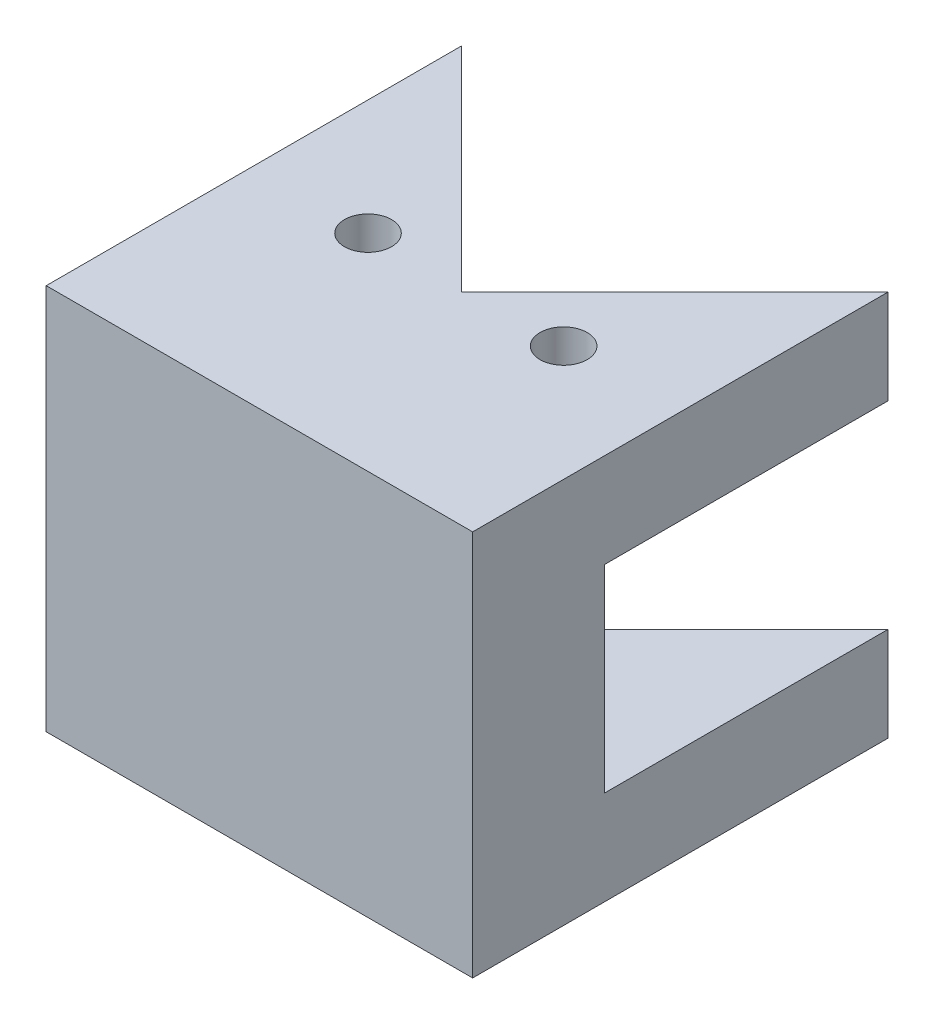
ISO-10303-21;
HEADER;
FILE_DESCRIPTION(('STEP AP214'),'2;1');
FILE_NAME('part.step','',(''),(''),'','','');
FILE_SCHEMA(('AUTOMOTIVE_DESIGN { 1 0 10303 214 1 1 1 1 }'));
ENDSEC;
DATA;
#1=APPLICATION_CONTEXT('core data for automotive mechanical design processes');
#2=APPLICATION_PROTOCOL_DEFINITION('international standard','automotive_design',2000,#1);
#3=PRODUCT_CONTEXT('',#1,'mechanical');
#4=PRODUCT('Part','Part','',(#3));
#5=PRODUCT_RELATED_PRODUCT_CATEGORY('part','',(#4));
#6=PRODUCT_DEFINITION_FORMATION('','',#4);
#7=PRODUCT_DEFINITION_CONTEXT('part definition',#1,'design');
#8=PRODUCT_DEFINITION('design','',#6,#7);
#9=PRODUCT_DEFINITION_SHAPE('','',#8);
#10=(LENGTH_UNIT() NAMED_UNIT(*) SI_UNIT(.MILLI.,.METRE.));
#11=(NAMED_UNIT(*) PLANE_ANGLE_UNIT() SI_UNIT($,.RADIAN.));
#12=(NAMED_UNIT(*) SI_UNIT($,.STERADIAN.) SOLID_ANGLE_UNIT());
#13=UNCERTAINTY_MEASURE_WITH_UNIT(LENGTH_MEASURE(1.E-05),#10,'distance_accuracy_value','');
#14=(GEOMETRIC_REPRESENTATION_CONTEXT(3) GLOBAL_UNCERTAINTY_ASSIGNED_CONTEXT((#13)) GLOBAL_UNIT_ASSIGNED_CONTEXT((#10,
#11,#12)) REPRESENTATION_CONTEXT('',''));
#15=CARTESIAN_POINT('',(0.,0.,0.));
#16=DIRECTION('',(0.,0.,1.));
#17=DIRECTION('',(1.,0.,0.));
#18=AXIS2_PLACEMENT_3D('',#15,#16,#17);
#19=CARTESIAN_POINT('',(0.,0.,0.));
#20=DIRECTION('',(0.,0.,1.));
#21=DIRECTION('',(1.,0.,0.));
#22=AXIS2_PLACEMENT_3D('',#19,#20,#21);
#23=PLANE('',#22);
#24=DIRECTION('',(1.,0.,0.));
#25=VECTOR('',#24,1.);
#26=CARTESIAN_POINT('',(45.25,21.,0.));
#27=LINE('',#26,#25);
#28=CARTESIAN_POINT('',(0.,21.,0.));
#29=VERTEX_POINT('',#28);
#30=CARTESIAN_POINT('',(5.940166048979,21.,0.));
#31=VERTEX_POINT('',#30);
#32=EDGE_CURVE('E223',#29,#31,#27,.T.);
#33=ORIENTED_EDGE('',*,*,#32,.T.);
#34=DIRECTION('',(0.,1.,0.));
#35=VECTOR('',#34,1.);
#36=CARTESIAN_POINT('',(5.940166048979,0.,0.));
#37=LINE('',#36,#35);
#38=CARTESIAN_POINT('',(5.940166048979,0.,0.));
#39=VERTEX_POINT('',#38);
#40=EDGE_CURVE('E59',#39,#31,#37,.T.);
#41=ORIENTED_EDGE('',*,*,#40,.F.);
#42=DIRECTION('',(1.,0.,0.));
#43=VECTOR('',#42,1.);
#44=CARTESIAN_POINT('',(0.,0.,0.));
#45=LINE('',#44,#43);
#46=CARTESIAN_POINT('',(0.,0.,0.));
#47=VERTEX_POINT('',#46);
#48=EDGE_CURVE('E261',#47,#39,#45,.T.);
#49=ORIENTED_EDGE('',*,*,#48,.F.);
#50=DIRECTION('',(0.,1.,0.));
#51=VECTOR('',#50,1.);
#52=CARTESIAN_POINT('',(0.,0.,0.));
#53=LINE('',#52,#51);
#54=EDGE_CURVE('E269',#47,#29,#53,.T.);
#55=ORIENTED_EDGE('',*,*,#54,.T.);
#56=EDGE_LOOP('',(#33,#41,#49,#55));
#57=FACE_BOUND('',#56,.T.);
#58=ADVANCED_FACE('F41',(#57),#23,.F.);
#59=CARTESIAN_POINT('',(0.,0.,0.));
#60=DIRECTION('',(0.,1.,0.));
#61=DIRECTION('',(0.,0.,1.));
#62=AXIS2_PLACEMENT_3D('',#59,#60,#61);
#63=PLANE('',#62);
#64=CARTESIAN_POINT('',(12.2468310289526,0.,-7.9));
#65=DIRECTION('',(0.,1.,0.));
#66=DIRECTION('',(0.,0.,1.));
#67=AXIS2_PLACEMENT_3D('',#64,#65,#66);
#68=CIRCLE('',#67,2.5);
#69=CARTESIAN_POINT('',(12.2468310289526,0.,-5.4));
#70=VERTEX_POINT('',#69);
#71=EDGE_CURVE('E308',#70,#70,#68,.T.);
#72=ORIENTED_EDGE('',*,*,#71,.F.);
#73=EDGE_LOOP('',(#72));
#74=FACE_BOUND('',#73,.T.);
#75=CARTESIAN_POINT('',(33.0031689710474,0.,-7.9));
#76=DIRECTION('',(0.,1.,0.));
#77=DIRECTION('',(0.,0.,1.));
#78=AXIS2_PLACEMENT_3D('',#75,#76,#77);
#79=CIRCLE('',#78,2.5);
#80=CARTESIAN_POINT('',(33.0031689710474,0.,-5.4));
#81=VERTEX_POINT('',#80);
#82=EDGE_CURVE('E172',#81,#81,#79,.T.);
#83=ORIENTED_EDGE('',*,*,#82,.F.);
#84=EDGE_LOOP('',(#83));
#85=FACE_BOUND('',#84,.T.);
#86=DIRECTION('',(0.,0.,-1.));
#87=VECTOR('',#86,1.);
#88=CARTESIAN_POINT('',(0.,0.,-30.05));
#89=LINE('',#88,#87);
#90=CARTESIAN_POINT('',(0.,0.,-30.05));
#91=VERTEX_POINT('',#90);
#92=EDGE_CURVE('E272',#47,#91,#89,.T.);
#93=ORIENTED_EDGE('',*,*,#92,.F.);
#94=ORIENTED_EDGE('',*,*,#48,.T.);
#95=DIRECTION('',(0.,0.,-1.));
#96=VECTOR('',#95,1.);
#97=CARTESIAN_POINT('',(5.940166048979,0.,5.));
#98=LINE('',#97,#96);
#99=CARTESIAN_POINT('',(5.940166048979,0.,5.));
#100=VERTEX_POINT('',#99);
#101=EDGE_CURVE('E207',#100,#39,#98,.T.);
#102=ORIENTED_EDGE('',*,*,#101,.F.);
#103=DIRECTION('',(-1.,0.,0.));
#104=VECTOR('',#103,1.);
#105=CARTESIAN_POINT('',(39.309833951021,0.,5.));
#106=LINE('',#105,#104);
#107=CARTESIAN_POINT('',(39.309833951021,0.,5.));
#108=VERTEX_POINT('',#107);
#109=EDGE_CURVE('E197',#108,#100,#106,.T.);
#110=ORIENTED_EDGE('',*,*,#109,.F.);
#111=DIRECTION('',(0.,0.,-1.));
#112=VECTOR('',#111,1.);
#113=CARTESIAN_POINT('',(39.309833951021,0.,5.));
#114=LINE('',#113,#112);
#115=CARTESIAN_POINT('',(39.309833951021,0.,0.));
#116=VERTEX_POINT('',#115);
#117=EDGE_CURVE('E211',#108,#116,#114,.T.);
#118=ORIENTED_EDGE('',*,*,#117,.T.);
#119=CARTESIAN_POINT('',(45.25,0.,0.));
#120=VERTEX_POINT('',#119);
#121=EDGE_CURVE('E67',#116,#120,#45,.T.);
#122=ORIENTED_EDGE('',*,*,#121,.T.);
#123=DIRECTION('',(0.,0.,1.));
#124=VECTOR('',#123,1.);
#125=CARTESIAN_POINT('',(45.25,0.,0.));
#126=LINE('',#125,#124);
#127=CARTESIAN_POINT('',(45.25,0.,-30.05));
#128=VERTEX_POINT('',#127);
#129=EDGE_CURVE('E154',#128,#120,#126,.T.);
#130=ORIENTED_EDGE('',*,*,#129,.F.);
#131=DIRECTION('',(0.70703125,0.,-0.707182304305925));
#132=VECTOR('',#131,1.);
#133=CARTESIAN_POINT('',(45.25,0.,-30.05));
#134=LINE('',#133,#132);
#135=CARTESIAN_POINT('',(22.625,0.,-7.42016626221041));
#136=VERTEX_POINT('',#135);
#137=EDGE_CURVE('E287',#136,#128,#134,.T.);
#138=ORIENTED_EDGE('',*,*,#137,.F.);
#139=DIRECTION('',(0.70703125,0.,0.707182304305925));
#140=VECTOR('',#139,1.);
#141=CARTESIAN_POINT('',(22.625,0.,-7.42016626221041));
#142=LINE('',#141,#140);
#143=EDGE_CURVE('E284',#91,#136,#142,.T.);
#144=ORIENTED_EDGE('',*,*,#143,.F.);
#145=EDGE_LOOP('',(#93,#94,#102,#110,#118,#122,#130,#138,#144));
#146=FACE_BOUND('',#145,.T.);
#147=ADVANCED_FACE('F361',(#74,#85,#146),#63,.T.);
#148=CARTESIAN_POINT('',(0.,-10.,-30.05));
#149=DIRECTION('',(1.,0.,0.));
#150=DIRECTION('',(0.,0.,-1.));
#151=AXIS2_PLACEMENT_3D('',#148,#149,#150);
#152=PLANE('',#151);
#153=DIRECTION('',(0.,0.,-1.));
#154=VECTOR('',#153,1.);
#155=CARTESIAN_POINT('',(0.,-10.,-30.05));
#156=LINE('',#155,#154);
#157=CARTESIAN_POINT('',(0.,-10.,14.));
#158=VERTEX_POINT('',#157);
#159=CARTESIAN_POINT('',(0.,-10.,-30.05));
#160=VERTEX_POINT('',#159);
#161=EDGE_CURVE('E147',#158,#160,#156,.T.);
#162=ORIENTED_EDGE('',*,*,#161,.F.);
#163=DIRECTION('',(0.,-1.,0.));
#164=VECTOR('',#163,1.);
#165=CARTESIAN_POINT('',(0.,31.,14.));
#166=LINE('',#165,#164);
#167=CARTESIAN_POINT('',(0.,31.,14.));
#168=VERTEX_POINT('',#167);
#169=EDGE_CURVE('E150',#168,#158,#166,.T.);
#170=ORIENTED_EDGE('',*,*,#169,.F.);
#171=DIRECTION('',(0.,0.,1.));
#172=VECTOR('',#171,1.);
#173=CARTESIAN_POINT('',(0.,31.,0.));
#174=LINE('',#173,#172);
#175=CARTESIAN_POINT('',(0.,31.,-30.05));
#176=VERTEX_POINT('',#175);
#177=EDGE_CURVE('E255',#176,#168,#174,.T.);
#178=ORIENTED_EDGE('',*,*,#177,.F.);
#179=DIRECTION('',(0.,-1.,0.));
#180=VECTOR('',#179,1.);
#181=CARTESIAN_POINT('',(0.,31.,-30.05));
#182=LINE('',#181,#180);
#183=CARTESIAN_POINT('',(0.,21.,-30.05));
#184=VERTEX_POINT('',#183);
#185=EDGE_CURVE('E227',#176,#184,#182,.T.);
#186=ORIENTED_EDGE('',*,*,#185,.T.);
#187=DIRECTION('',(0.,0.,1.));
#188=VECTOR('',#187,1.);
#189=CARTESIAN_POINT('',(0.,21.,0.));
#190=LINE('',#189,#188);
#191=EDGE_CURVE('E237',#184,#29,#190,.T.);
#192=ORIENTED_EDGE('',*,*,#191,.T.);
#193=ORIENTED_EDGE('',*,*,#54,.F.);
#194=ORIENTED_EDGE('',*,*,#92,.T.);
#195=DIRECTION('',(0.,1.,0.));
#196=VECTOR('',#195,1.);
#197=CARTESIAN_POINT('',(0.,-10.,-30.05));
#198=LINE('',#197,#196);
#199=EDGE_CURVE('E11',#160,#91,#198,.T.);
#200=ORIENTED_EDGE('',*,*,#199,.F.);
#201=EDGE_LOOP('',(#162,#170,#178,#186,#192,#193,#194,#200));
#202=FACE_BOUND('',#201,.T.);
#203=ADVANCED_FACE('F43',(#202),#152,.F.);
#204=CARTESIAN_POINT('',(22.625,-10.,-7.42016626221041));
#205=DIRECTION('',(-0.707182304305925,0.,0.70703125));
#206=DIRECTION('',(0.70703125,0.,0.707182304305925));
#207=AXIS2_PLACEMENT_3D('',#204,#205,#206);
#208=PLANE('',#207);
#209=ORIENTED_EDGE('',*,*,#143,.T.);
#210=DIRECTION('',(0.,1.,0.));
#211=VECTOR('',#210,1.);
#212=CARTESIAN_POINT('',(22.625,-10.,-7.42016626221041));
#213=LINE('',#212,#211);
#214=CARTESIAN_POINT('',(22.625,-10.,-7.42016626221041));
#215=VERTEX_POINT('',#214);
#216=EDGE_CURVE('E51',#215,#136,#213,.T.);
#217=ORIENTED_EDGE('',*,*,#216,.F.);
#218=DIRECTION('',(0.70703125,0.,0.707182304305925));
#219=VECTOR('',#218,1.);
#220=CARTESIAN_POINT('',(22.625,-10.,-7.42016626221041));
#221=LINE('',#220,#219);
#222=EDGE_CURVE('E153',#160,#215,#221,.T.);
#223=ORIENTED_EDGE('',*,*,#222,.F.);
#224=ORIENTED_EDGE('',*,*,#199,.T.);
#225=EDGE_LOOP('',(#209,#217,#223,#224));
#226=FACE_BOUND('',#225,.T.);
#227=ADVANCED_FACE('F398',(#226),#208,.F.);
#228=CARTESIAN_POINT('',(45.25,-10.,-30.05));
#229=DIRECTION('',(0.707182304305925,0.,0.70703125));
#230=DIRECTION('',(0.70703125,0.,-0.707182304305925));
#231=AXIS2_PLACEMENT_3D('',#228,#229,#230);
#232=PLANE('',#231);
#233=ORIENTED_EDGE('',*,*,#137,.T.);
#234=DIRECTION('',(0.,1.,0.));
#235=VECTOR('',#234,1.);
#236=CARTESIAN_POINT('',(45.25,-10.,-30.05));
#237=LINE('',#236,#235);
#238=CARTESIAN_POINT('',(45.25,-10.,-30.05));
#239=VERTEX_POINT('',#238);
#240=EDGE_CURVE('E281',#239,#128,#237,.T.);
#241=ORIENTED_EDGE('',*,*,#240,.F.);
#242=DIRECTION('',(0.70703125,0.,-0.707182304305925));
#243=VECTOR('',#242,1.);
#244=CARTESIAN_POINT('',(45.25,-10.,-30.05));
#245=LINE('',#244,#243);
#246=EDGE_CURVE('E276',#215,#239,#245,.T.);
#247=ORIENTED_EDGE('',*,*,#246,.F.);
#248=ORIENTED_EDGE('',*,*,#216,.T.);
#249=EDGE_LOOP('',(#233,#241,#247,#248));
#250=FACE_BOUND('',#249,.T.);
#251=ADVANCED_FACE('F396',(#250),#232,.F.);
#252=CARTESIAN_POINT('',(45.25,-10.,0.));
#253=DIRECTION('',(-1.,0.,0.));
#254=DIRECTION('',(0.,0.,1.));
#255=AXIS2_PLACEMENT_3D('',#252,#253,#254);
#256=PLANE('',#255);
#257=ORIENTED_EDGE('',*,*,#129,.T.);
#258=DIRECTION('',(0.,1.,0.));
#259=VECTOR('',#258,1.);
#260=CARTESIAN_POINT('',(45.25,0.,0.));
#261=LINE('',#260,#259);
#262=CARTESIAN_POINT('',(45.25,21.,0.));
#263=VERTEX_POINT('',#262);
#264=EDGE_CURVE('E265',#120,#263,#261,.T.);
#265=ORIENTED_EDGE('',*,*,#264,.T.);
#266=DIRECTION('',(0.,0.,-1.));
#267=VECTOR('',#266,1.);
#268=CARTESIAN_POINT('',(45.25,21.,-30.05));
#269=LINE('',#268,#267);
#270=CARTESIAN_POINT('',(45.25,21.,-30.05));
#271=VERTEX_POINT('',#270);
#272=EDGE_CURVE('E210',#263,#271,#269,.T.);
#273=ORIENTED_EDGE('',*,*,#272,.T.);
#274=DIRECTION('',(0.,-1.,0.));
#275=VECTOR('',#274,1.);
#276=CARTESIAN_POINT('',(45.25,31.,-30.05));
#277=LINE('',#276,#275);
#278=CARTESIAN_POINT('',(45.25,31.,-30.05));
#279=VERTEX_POINT('',#278);
#280=EDGE_CURVE('E251',#279,#271,#277,.T.);
#281=ORIENTED_EDGE('',*,*,#280,.F.);
#282=DIRECTION('',(0.,0.,-1.));
#283=VECTOR('',#282,1.);
#284=CARTESIAN_POINT('',(45.25,31.,0.));
#285=LINE('',#284,#283);
#286=CARTESIAN_POINT('',(45.25,31.,14.));
#287=VERTEX_POINT('',#286);
#288=EDGE_CURVE('E258',#287,#279,#285,.T.);
#289=ORIENTED_EDGE('',*,*,#288,.F.);
#290=DIRECTION('',(0.,1.,0.));
#291=VECTOR('',#290,1.);
#292=CARTESIAN_POINT('',(45.25,31.,14.));
#293=LINE('',#292,#291);
#294=CARTESIAN_POINT('',(45.25,-10.,14.));
#295=VERTEX_POINT('',#294);
#296=EDGE_CURVE('E165',#295,#287,#293,.T.);
#297=ORIENTED_EDGE('',*,*,#296,.F.);
#298=DIRECTION('',(0.,0.,1.));
#299=VECTOR('',#298,1.);
#300=CARTESIAN_POINT('',(45.25,-10.,0.));
#301=LINE('',#300,#299);
#302=EDGE_CURVE('E160',#239,#295,#301,.T.);
#303=ORIENTED_EDGE('',*,*,#302,.F.);
#304=ORIENTED_EDGE('',*,*,#240,.T.);
#305=EDGE_LOOP('',(#257,#265,#273,#281,#289,#297,#303,#304));
#306=FACE_BOUND('',#305,.T.);
#307=ADVANCED_FACE('F343',(#306),#256,.F.);
#308=CARTESIAN_POINT('',(0.,-10.,0.));
#309=DIRECTION('',(0.,1.,0.));
#310=DIRECTION('',(0.,0.,1.));
#311=AXIS2_PLACEMENT_3D('',#308,#309,#310);
#312=PLANE('',#311);
#313=CARTESIAN_POINT('',(12.2468310289526,-10.,-7.9));
#314=DIRECTION('',(0.,1.,0.));
#315=DIRECTION('',(0.,0.,1.));
#316=AXIS2_PLACEMENT_3D('',#313,#314,#315);
#317=CIRCLE('',#316,2.5);
#318=CARTESIAN_POINT('',(12.2468310289526,-10.,-5.4));
#319=VERTEX_POINT('',#318);
#320=EDGE_CURVE('E314',#319,#319,#317,.T.);
#321=ORIENTED_EDGE('',*,*,#320,.T.);
#322=EDGE_LOOP('',(#321));
#323=FACE_BOUND('',#322,.T.);
#324=CARTESIAN_POINT('',(33.0031689710474,-10.,-7.9));
#325=DIRECTION('',(0.,1.,0.));
#326=DIRECTION('',(0.,0.,1.));
#327=AXIS2_PLACEMENT_3D('',#324,#325,#326);
#328=CIRCLE('',#327,2.5);
#329=CARTESIAN_POINT('',(33.0031689710474,-10.,-5.4));
#330=VERTEX_POINT('',#329);
#331=EDGE_CURVE('E176',#330,#330,#328,.T.);
#332=ORIENTED_EDGE('',*,*,#331,.T.);
#333=EDGE_LOOP('',(#332));
#334=FACE_BOUND('',#333,.T.);
#335=ORIENTED_EDGE('',*,*,#161,.T.);
#336=ORIENTED_EDGE('',*,*,#222,.T.);
#337=ORIENTED_EDGE('',*,*,#246,.T.);
#338=ORIENTED_EDGE('',*,*,#302,.T.);
#339=DIRECTION('',(1.,0.,0.));
#340=VECTOR('',#339,1.);
#341=CARTESIAN_POINT('',(0.,-10.,14.));
#342=LINE('',#341,#340);
#343=EDGE_CURVE('E157',#158,#295,#342,.T.);
#344=ORIENTED_EDGE('',*,*,#343,.F.);
#345=EDGE_LOOP('',(#335,#336,#337,#338,#344));
#346=FACE_BOUND('',#345,.T.);
#347=ADVANCED_FACE('F158',(#323,#334,#346),#312,.F.);
#348=ORIENTED_EDGE('',*,*,#121,.F.);
#349=DIRECTION('',(0.,-1.,0.));
#350=VECTOR('',#349,1.);
#351=CARTESIAN_POINT('',(39.309833951021,0.,0.));
#352=LINE('',#351,#350);
#353=CARTESIAN_POINT('',(39.309833951021,21.,0.));
#354=VERTEX_POINT('',#353);
#355=EDGE_CURVE('E189',#354,#116,#352,.T.);
#356=ORIENTED_EDGE('',*,*,#355,.F.);
#357=EDGE_CURVE('E240',#354,#263,#27,.T.);
#358=ORIENTED_EDGE('',*,*,#357,.T.);
#359=ORIENTED_EDGE('',*,*,#264,.F.);
#360=EDGE_LOOP('',(#348,#356,#358,#359));
#361=FACE_BOUND('',#360,.T.);
#362=ADVANCED_FACE('F345',(#361),#23,.F.);
#363=CARTESIAN_POINT('',(0.,31.,0.));
#364=DIRECTION('',(0.,1.,0.));
#365=DIRECTION('',(0.,0.,1.));
#366=AXIS2_PLACEMENT_3D('',#363,#364,#365);
#367=PLANE('',#366);
#368=CARTESIAN_POINT('',(12.2468310289526,31.,-7.9));
#369=DIRECTION('',(0.,1.,0.));
#370=DIRECTION('',(0.,0.,1.));
#371=AXIS2_PLACEMENT_3D('',#368,#369,#370);
#372=CIRCLE('',#371,2.5);
#373=CARTESIAN_POINT('',(12.2468310289526,31.,-5.4));
#374=VERTEX_POINT('',#373);
#375=EDGE_CURVE('E320',#374,#374,#372,.T.);
#376=ORIENTED_EDGE('',*,*,#375,.F.);
#377=EDGE_LOOP('',(#376));
#378=FACE_BOUND('',#377,.T.);
#379=CARTESIAN_POINT('',(33.0031689710474,31.,-7.9));
#380=DIRECTION('',(0.,1.,0.));
#381=DIRECTION('',(0.,0.,1.));
#382=AXIS2_PLACEMENT_3D('',#379,#380,#381);
#383=CIRCLE('',#382,2.5);
#384=CARTESIAN_POINT('',(33.0031689710474,31.,-5.4));
#385=VERTEX_POINT('',#384);
#386=EDGE_CURVE('E301',#385,#385,#383,.T.);
#387=ORIENTED_EDGE('',*,*,#386,.F.);
#388=EDGE_LOOP('',(#387));
#389=FACE_BOUND('',#388,.T.);
#390=ORIENTED_EDGE('',*,*,#177,.T.);
#391=DIRECTION('',(-1.,0.,0.));
#392=VECTOR('',#391,1.);
#393=CARTESIAN_POINT('',(0.,31.,14.));
#394=LINE('',#393,#392);
#395=EDGE_CURVE('E170',#287,#168,#394,.T.);
#396=ORIENTED_EDGE('',*,*,#395,.F.);
#397=ORIENTED_EDGE('',*,*,#288,.T.);
#398=DIRECTION('',(-0.70703125,0.,0.707182304305925));
#399=VECTOR('',#398,1.);
#400=CARTESIAN_POINT('',(22.625,31.,-7.42016626221041));
#401=LINE('',#400,#399);
#402=CARTESIAN_POINT('',(22.625,31.,-7.42016626221041));
#403=VERTEX_POINT('',#402);
#404=EDGE_CURVE('E219',#279,#403,#401,.T.);
#405=ORIENTED_EDGE('',*,*,#404,.T.);
#406=DIRECTION('',(-0.70703125,0.,-0.707182304305925));
#407=VECTOR('',#406,1.);
#408=CARTESIAN_POINT('',(0.,31.,-30.05));
#409=LINE('',#408,#407);
#410=EDGE_CURVE('E222',#403,#176,#409,.T.);
#411=ORIENTED_EDGE('',*,*,#410,.T.);
#412=EDGE_LOOP('',(#390,#396,#397,#405,#411));
#413=FACE_BOUND('',#412,.T.);
#414=ADVANCED_FACE('F373',(#378,#389,#413),#367,.T.);
#415=CARTESIAN_POINT('',(22.625,31.,-7.42016626221041));
#416=DIRECTION('',(0.707182304305925,0.,0.70703125));
#417=DIRECTION('',(0.70703125,0.,-0.707182304305925));
#418=AXIS2_PLACEMENT_3D('',#415,#416,#417);
#419=PLANE('',#418);
#420=DIRECTION('',(-0.70703125,0.,0.707182304305925));
#421=VECTOR('',#420,1.);
#422=CARTESIAN_POINT('',(22.625,21.,-7.42016626221041));
#423=LINE('',#422,#421);
#424=CARTESIAN_POINT('',(22.625,21.,-7.42016626221041));
#425=VERTEX_POINT('',#424);
#426=EDGE_CURVE('E231',#271,#425,#423,.T.);
#427=ORIENTED_EDGE('',*,*,#426,.T.);
#428=DIRECTION('',(0.,-1.,0.));
#429=VECTOR('',#428,1.);
#430=CARTESIAN_POINT('',(22.625,31.,-7.42016626221041));
#431=LINE('',#430,#429);
#432=EDGE_CURVE('E247',#403,#425,#431,.T.);
#433=ORIENTED_EDGE('',*,*,#432,.F.);
#434=ORIENTED_EDGE('',*,*,#404,.F.);
#435=ORIENTED_EDGE('',*,*,#280,.T.);
#436=EDGE_LOOP('',(#427,#433,#434,#435));
#437=FACE_BOUND('',#436,.T.);
#438=ADVANCED_FACE('F371',(#437),#419,.F.);
#439=CARTESIAN_POINT('',(0.,31.,-30.05));
#440=DIRECTION('',(-0.707182304305925,0.,0.70703125));
#441=DIRECTION('',(0.70703125,0.,0.707182304305925));
#442=AXIS2_PLACEMENT_3D('',#439,#440,#441);
#443=PLANE('',#442);
#444=DIRECTION('',(-0.70703125,0.,-0.707182304305925));
#445=VECTOR('',#444,1.);
#446=CARTESIAN_POINT('',(0.,21.,-30.05));
#447=LINE('',#446,#445);
#448=EDGE_CURVE('E234',#425,#184,#447,.T.);
#449=ORIENTED_EDGE('',*,*,#448,.T.);
#450=ORIENTED_EDGE('',*,*,#185,.F.);
#451=ORIENTED_EDGE('',*,*,#410,.F.);
#452=ORIENTED_EDGE('',*,*,#432,.T.);
#453=EDGE_LOOP('',(#449,#450,#451,#452));
#454=FACE_BOUND('',#453,.T.);
#455=ADVANCED_FACE('F335',(#454),#443,.F.);
#456=CARTESIAN_POINT('',(0.,21.,0.));
#457=DIRECTION('',(0.,-1.,0.));
#458=DIRECTION('',(0.,0.,-1.));
#459=AXIS2_PLACEMENT_3D('',#456,#457,#458);
#460=PLANE('',#459);
#461=CARTESIAN_POINT('',(12.2468310289526,21.,-7.9));
#462=DIRECTION('',(0.,-1.,0.));
#463=DIRECTION('',(0.,0.,-1.));
#464=AXIS2_PLACEMENT_3D('',#461,#462,#463);
#465=CIRCLE('',#464,2.5);
#466=CARTESIAN_POINT('',(12.2468310289526,21.,-5.4));
#467=VERTEX_POINT('',#466);
#468=EDGE_CURVE('E45',#467,#467,#465,.T.);
#469=ORIENTED_EDGE('',*,*,#468,.F.);
#470=EDGE_LOOP('',(#469));
#471=FACE_BOUND('',#470,.T.);
#472=CARTESIAN_POINT('',(33.0031689710474,21.,-7.9));
#473=DIRECTION('',(0.,-1.,0.));
#474=DIRECTION('',(0.,0.,-1.));
#475=AXIS2_PLACEMENT_3D('',#472,#473,#474);
#476=CIRCLE('',#475,2.5);
#477=CARTESIAN_POINT('',(33.0031689710474,21.,-5.4));
#478=VERTEX_POINT('',#477);
#479=EDGE_CURVE('E298',#478,#478,#476,.T.);
#480=ORIENTED_EDGE('',*,*,#479,.F.);
#481=EDGE_LOOP('',(#480));
#482=FACE_BOUND('',#481,.T.);
#483=ORIENTED_EDGE('',*,*,#272,.F.);
#484=ORIENTED_EDGE('',*,*,#357,.F.);
#485=DIRECTION('',(0.,0.,-1.));
#486=VECTOR('',#485,1.);
#487=CARTESIAN_POINT('',(39.309833951021,21.,5.));
#488=LINE('',#487,#486);
#489=CARTESIAN_POINT('',(39.309833951021,21.,5.));
#490=VERTEX_POINT('',#489);
#491=EDGE_CURVE('E214',#490,#354,#488,.T.);
#492=ORIENTED_EDGE('',*,*,#491,.F.);
#493=DIRECTION('',(1.,0.,0.));
#494=VECTOR('',#493,1.);
#495=CARTESIAN_POINT('',(39.309833951021,21.,5.));
#496=LINE('',#495,#494);
#497=CARTESIAN_POINT('',(5.940166048979,21.,5.));
#498=VERTEX_POINT('',#497);
#499=EDGE_CURVE('E188',#498,#490,#496,.T.);
#500=ORIENTED_EDGE('',*,*,#499,.F.);
#501=DIRECTION('',(0.,0.,-1.));
#502=VECTOR('',#501,1.);
#503=CARTESIAN_POINT('',(5.940166048979,21.,5.));
#504=LINE('',#503,#502);
#505=EDGE_CURVE('E201',#498,#31,#504,.T.);
#506=ORIENTED_EDGE('',*,*,#505,.T.);
#507=ORIENTED_EDGE('',*,*,#32,.F.);
#508=ORIENTED_EDGE('',*,*,#191,.F.);
#509=ORIENTED_EDGE('',*,*,#448,.F.);
#510=ORIENTED_EDGE('',*,*,#426,.F.);
#511=EDGE_LOOP('',(#483,#484,#492,#500,#506,#507,#508,#509,#510));
#512=FACE_BOUND('',#511,.T.);
#513=ADVANCED_FACE('F331',(#471,#482,#512),#460,.T.);
#514=CARTESIAN_POINT('',(5.940166048979,0.,5.));
#515=DIRECTION('',(-1.,0.,0.));
#516=DIRECTION('',(0.,0.,1.));
#517=AXIS2_PLACEMENT_3D('',#514,#515,#516);
#518=PLANE('',#517);
#519=ORIENTED_EDGE('',*,*,#40,.T.);
#520=ORIENTED_EDGE('',*,*,#505,.F.);
#521=DIRECTION('',(0.,1.,0.));
#522=VECTOR('',#521,1.);
#523=CARTESIAN_POINT('',(5.940166048979,0.,5.));
#524=LINE('',#523,#522);
#525=EDGE_CURVE('E184',#100,#498,#524,.T.);
#526=ORIENTED_EDGE('',*,*,#525,.F.);
#527=ORIENTED_EDGE('',*,*,#101,.T.);
#528=EDGE_LOOP('',(#519,#520,#526,#527));
#529=FACE_BOUND('',#528,.T.);
#530=ADVANCED_FACE('F334',(#529),#518,.F.);
#531=CARTESIAN_POINT('',(39.309833951021,0.,5.));
#532=DIRECTION('',(1.,0.,0.));
#533=DIRECTION('',(0.,0.,-1.));
#534=AXIS2_PLACEMENT_3D('',#531,#532,#533);
#535=PLANE('',#534);
#536=ORIENTED_EDGE('',*,*,#355,.T.);
#537=ORIENTED_EDGE('',*,*,#117,.F.);
#538=DIRECTION('',(0.,-1.,0.));
#539=VECTOR('',#538,1.);
#540=CARTESIAN_POINT('',(39.309833951021,0.,5.));
#541=LINE('',#540,#539);
#542=EDGE_CURVE('E193',#490,#108,#541,.T.);
#543=ORIENTED_EDGE('',*,*,#542,.F.);
#544=ORIENTED_EDGE('',*,*,#491,.T.);
#545=EDGE_LOOP('',(#536,#537,#543,#544));
#546=FACE_BOUND('',#545,.T.);
#547=ADVANCED_FACE('F350',(#546),#535,.F.);
#548=CARTESIAN_POINT('',(0.,0.,5.));
#549=DIRECTION('',(0.,0.,1.));
#550=DIRECTION('',(1.,0.,0.));
#551=AXIS2_PLACEMENT_3D('',#548,#549,#550);
#552=PLANE('',#551);
#553=ORIENTED_EDGE('',*,*,#525,.T.);
#554=ORIENTED_EDGE('',*,*,#499,.T.);
#555=ORIENTED_EDGE('',*,*,#542,.T.);
#556=ORIENTED_EDGE('',*,*,#109,.T.);
#557=EDGE_LOOP('',(#553,#554,#555,#556));
#558=FACE_BOUND('',#557,.T.);
#559=ADVANCED_FACE('F356',(#558),#552,.F.);
#560=CARTESIAN_POINT('',(0.,0.,14.));
#561=DIRECTION('',(0.,0.,1.));
#562=DIRECTION('',(1.,0.,0.));
#563=AXIS2_PLACEMENT_3D('',#560,#561,#562);
#564=PLANE('',#563);
#565=ORIENTED_EDGE('',*,*,#169,.T.);
#566=ORIENTED_EDGE('',*,*,#343,.T.);
#567=ORIENTED_EDGE('',*,*,#296,.T.);
#568=ORIENTED_EDGE('',*,*,#395,.T.);
#569=EDGE_LOOP('',(#565,#566,#567,#568));
#570=FACE_BOUND('',#569,.T.);
#571=ADVANCED_FACE('F168',(#570),#564,.T.);
#572=CARTESIAN_POINT('',(33.0031689710474,-14.,-7.9));
#573=DIRECTION('',(0.,1.,0.));
#574=DIRECTION('',(0.,0.,1.));
#575=AXIS2_PLACEMENT_3D('',#572,#573,#574);
#576=CYLINDRICAL_SURFACE('',#575,2.5);
#577=CARTESIAN_POINT('',(33.0031689710474,21.,-5.4));
#578=CARTESIAN_POINT('',(33.0031689710474,21.1041666666667,-5.4));
#579=CARTESIAN_POINT('',(33.0031689710474,21.2083333333333,-5.4));
#580=CARTESIAN_POINT('',(33.0031689710474,21.4166666666667,-5.4));
#581=CARTESIAN_POINT('',(33.0031689710474,21.5208333333333,-5.4));
#582=CARTESIAN_POINT('',(33.0031689710474,21.7291666666667,-5.4));
#583=CARTESIAN_POINT('',(33.0031689710474,21.8333333333333,-5.4));
#584=CARTESIAN_POINT('',(33.0031689710474,22.0416666666667,-5.4));
#585=CARTESIAN_POINT('',(33.0031689710474,22.1458333333333,-5.4));
#586=CARTESIAN_POINT('',(33.0031689710474,22.3541666666667,-5.4));
#587=CARTESIAN_POINT('',(33.0031689710474,22.4583333333333,-5.4));
#588=CARTESIAN_POINT('',(33.0031689710474,22.6666666666667,-5.4));
#589=CARTESIAN_POINT('',(33.0031689710474,22.7708333333333,-5.4));
#590=CARTESIAN_POINT('',(33.0031689710474,22.9791666666667,-5.4));
#591=CARTESIAN_POINT('',(33.0031689710474,23.0833333333333,-5.4));
#592=CARTESIAN_POINT('',(33.0031689710474,23.2916666666667,-5.4));
#593=CARTESIAN_POINT('',(33.0031689710474,23.3958333333333,-5.4));
#594=CARTESIAN_POINT('',(33.0031689710474,23.6041666666667,-5.4));
#595=CARTESIAN_POINT('',(33.0031689710474,23.7083333333333,-5.4));
#596=CARTESIAN_POINT('',(33.0031689710474,23.9166666666667,-5.4));
#597=CARTESIAN_POINT('',(33.0031689710474,24.0208333333333,-5.4));
#598=CARTESIAN_POINT('',(33.0031689710474,24.2291666666667,-5.4));
#599=CARTESIAN_POINT('',(33.0031689710474,24.3333333333333,-5.4));
#600=CARTESIAN_POINT('',(33.0031689710474,24.5416666666667,-5.4));
#601=CARTESIAN_POINT('',(33.0031689710474,24.6458333333333,-5.4));
#602=CARTESIAN_POINT('',(33.0031689710474,24.8541666666667,-5.4));
#603=CARTESIAN_POINT('',(33.0031689710474,24.9583333333333,-5.4));
#604=CARTESIAN_POINT('',(33.0031689710474,25.1666666666667,-5.4));
#605=CARTESIAN_POINT('',(33.0031689710474,25.2708333333333,-5.4));
#606=CARTESIAN_POINT('',(33.0031689710474,25.4791666666667,-5.4));
#607=CARTESIAN_POINT('',(33.0031689710474,25.5833333333333,-5.4));
#608=CARTESIAN_POINT('',(33.0031689710474,25.7916666666667,-5.4));
#609=CARTESIAN_POINT('',(33.0031689710474,25.8958333333333,-5.4));
#610=CARTESIAN_POINT('',(33.0031689710474,26.1041666666667,-5.4));
#611=CARTESIAN_POINT('',(33.0031689710474,26.2083333333333,-5.4));
#612=CARTESIAN_POINT('',(33.0031689710474,26.4166666666667,-5.4));
#613=CARTESIAN_POINT('',(33.0031689710474,26.5208333333333,-5.4));
#614=CARTESIAN_POINT('',(33.0031689710474,26.7291666666667,-5.4));
#615=CARTESIAN_POINT('',(33.0031689710474,26.8333333333333,-5.4));
#616=CARTESIAN_POINT('',(33.0031689710474,27.0416666666667,-5.4));
#617=CARTESIAN_POINT('',(33.0031689710474,27.1458333333333,-5.4));
#618=CARTESIAN_POINT('',(33.0031689710474,27.3541666666667,-5.4));
#619=CARTESIAN_POINT('',(33.0031689710474,27.4583333333333,-5.4));
#620=CARTESIAN_POINT('',(33.0031689710474,27.6666666666667,-5.4));
#621=CARTESIAN_POINT('',(33.0031689710474,27.7708333333333,-5.4));
#622=CARTESIAN_POINT('',(33.0031689710474,27.9791666666667,-5.4));
#623=CARTESIAN_POINT('',(33.0031689710474,28.0833333333333,-5.4));
#624=CARTESIAN_POINT('',(33.0031689710474,28.2916666666667,-5.4));
#625=CARTESIAN_POINT('',(33.0031689710474,28.3958333333333,-5.4));
#626=CARTESIAN_POINT('',(33.0031689710474,28.6041666666667,-5.4));
#627=CARTESIAN_POINT('',(33.0031689710474,28.7083333333333,-5.4));
#628=CARTESIAN_POINT('',(33.0031689710474,28.9166666666667,-5.4));
#629=CARTESIAN_POINT('',(33.0031689710474,29.0208333333333,-5.4));
#630=CARTESIAN_POINT('',(33.0031689710474,29.2291666666667,-5.4));
#631=CARTESIAN_POINT('',(33.0031689710474,29.3333333333333,-5.4));
#632=CARTESIAN_POINT('',(33.0031689710474,29.5416666666667,-5.4));
#633=CARTESIAN_POINT('',(33.0031689710474,29.6458333333333,-5.4));
#634=CARTESIAN_POINT('',(33.0031689710474,29.8541666666667,-5.4));
#635=CARTESIAN_POINT('',(33.0031689710474,29.9583333333333,-5.4));
#636=CARTESIAN_POINT('',(33.0031689710474,30.1666666666667,-5.4));
#637=CARTESIAN_POINT('',(33.0031689710474,30.2708333333333,-5.4));
#638=CARTESIAN_POINT('',(33.0031689710474,30.4791666666667,-5.4));
#639=CARTESIAN_POINT('',(33.0031689710474,30.5833333333333,-5.4));
#640=CARTESIAN_POINT('',(33.0031689710474,30.7916666666667,-5.4));
#641=CARTESIAN_POINT('',(33.0031689710474,30.8958333333333,-5.4));
#642=CARTESIAN_POINT('',(33.0031689710474,31.,-5.4));
#643=B_SPLINE_CURVE_WITH_KNOTS('',3,(#577,#578,#579,#580,#581,#582,#583,#584,#585,#586,#587,
#588,#589,#590,#591,#592,#593,#594,#595,#596,#597,#598,#599,#600,#601,#602,#603,#604,#605,#606,
#607,#608,#609,#610,#611,#612,#613,#614,#615,#616,#617,#618,#619,#620,#621,#622,#623,#624,#625,
#626,#627,#628,#629,#630,#631,#632,#633,#634,#635,#636,#637,#638,#639,#640,#641,#642),
.UNSPECIFIED.,.F.,.F.,(4,2,2,2,2,2,2,2,2,2,2,2,2,2,2,2,2,2,2,2,2,2,2,2,2,2,2,2,2,2,2,2,4),(0.,
0.3125,0.625000000000001,0.937500000000001,1.25,1.56249999999999,1.87499999999999,2.1875,2.5,
2.8125,3.125,3.4375,3.74999999999999,4.06249999999999,4.37499999999999,4.68749999999999,
4.99999999999999,5.31249999999999,5.62499999999999,5.93749999999999,6.24999999999999,
6.56249999999998,6.87499999999998,7.18749999999999,7.49999999999999,7.81249999999999,
8.12499999999999,8.43749999999999,8.74999999999998,9.06249999999999,9.37499999999998,
9.68749999999998,9.99999999999998),.UNSPECIFIED.);
#644=EDGE_CURVE('BSEAM471',#478,#385,#643,.T.);
#645=ORIENTED_EDGE('',*,*,#479,.T.);
#646=ORIENTED_EDGE('',*,*,#386,.T.);
#647=ORIENTED_EDGE('',*,*,#644,.T.);
#648=ORIENTED_EDGE('',*,*,#644,.F.);
#649=EDGE_LOOP('',(#645,#647,#646,#648));
#650=FACE_BOUND('',#649,.T.);
#651=ADVANCED_FACE('F471',(#650),#576,.F.);
#652=CARTESIAN_POINT('',(33.0031689710474,0.,-5.4));
#653=CARTESIAN_POINT('',(33.0031689710474,-0.104166666666668,-5.4));
#654=CARTESIAN_POINT('',(33.0031689710474,-0.208333333333335,-5.4));
#655=CARTESIAN_POINT('',(33.0031689710474,-0.416666666666669,-5.4));
#656=CARTESIAN_POINT('',(33.0031689710474,-0.520833333333335,-5.4));
#657=CARTESIAN_POINT('',(33.0031689710474,-0.729166666666669,-5.4));
#658=CARTESIAN_POINT('',(33.0031689710474,-0.833333333333336,-5.4));
#659=CARTESIAN_POINT('',(33.0031689710474,-1.04166666666667,-5.4));
#660=CARTESIAN_POINT('',(33.0031689710474,-1.14583333333333,-5.4));
#661=CARTESIAN_POINT('',(33.0031689710474,-1.35416666666667,-5.4));
#662=CARTESIAN_POINT('',(33.0031689710474,-1.45833333333333,-5.4));
#663=CARTESIAN_POINT('',(33.0031689710474,-1.66666666666667,-5.4));
#664=CARTESIAN_POINT('',(33.0031689710474,-1.77083333333334,-5.4));
#665=CARTESIAN_POINT('',(33.0031689710474,-1.97916666666667,-5.4));
#666=CARTESIAN_POINT('',(33.0031689710474,-2.08333333333334,-5.4));
#667=CARTESIAN_POINT('',(33.0031689710474,-2.29166666666667,-5.4));
#668=CARTESIAN_POINT('',(33.0031689710474,-2.39583333333334,-5.4));
#669=CARTESIAN_POINT('',(33.0031689710474,-2.60416666666667,-5.4));
#670=CARTESIAN_POINT('',(33.0031689710474,-2.70833333333333,-5.4));
#671=CARTESIAN_POINT('',(33.0031689710474,-2.91666666666667,-5.4));
#672=CARTESIAN_POINT('',(33.0031689710474,-3.02083333333333,-5.4));
#673=CARTESIAN_POINT('',(33.0031689710474,-3.22916666666667,-5.4));
#674=CARTESIAN_POINT('',(33.0031689710474,-3.33333333333333,-5.4));
#675=CARTESIAN_POINT('',(33.0031689710474,-3.54166666666667,-5.4));
#676=CARTESIAN_POINT('',(33.0031689710474,-3.64583333333333,-5.4));
#677=CARTESIAN_POINT('',(33.0031689710474,-3.85416666666667,-5.4));
#678=CARTESIAN_POINT('',(33.0031689710474,-3.95833333333334,-5.4));
#679=CARTESIAN_POINT('',(33.0031689710474,-4.16666666666667,-5.4));
#680=CARTESIAN_POINT('',(33.0031689710474,-4.27083333333334,-5.4));
#681=CARTESIAN_POINT('',(33.0031689710474,-4.47916666666667,-5.4));
#682=CARTESIAN_POINT('',(33.0031689710474,-4.58333333333334,-5.4));
#683=CARTESIAN_POINT('',(33.0031689710474,-4.79166666666667,-5.4));
#684=CARTESIAN_POINT('',(33.0031689710474,-4.89583333333334,-5.4));
#685=CARTESIAN_POINT('',(33.0031689710474,-5.10416666666667,-5.4));
#686=CARTESIAN_POINT('',(33.0031689710474,-5.20833333333334,-5.4));
#687=CARTESIAN_POINT('',(33.0031689710474,-5.41666666666667,-5.4));
#688=CARTESIAN_POINT('',(33.0031689710474,-5.52083333333333,-5.4));
#689=CARTESIAN_POINT('',(33.0031689710474,-5.72916666666667,-5.4));
#690=CARTESIAN_POINT('',(33.0031689710474,-5.83333333333334,-5.4));
#691=CARTESIAN_POINT('',(33.0031689710474,-6.04166666666667,-5.4));
#692=CARTESIAN_POINT('',(33.0031689710474,-6.14583333333333,-5.4));
#693=CARTESIAN_POINT('',(33.0031689710474,-6.35416666666667,-5.4));
#694=CARTESIAN_POINT('',(33.0031689710474,-6.45833333333333,-5.4));
#695=CARTESIAN_POINT('',(33.0031689710474,-6.66666666666667,-5.4));
#696=CARTESIAN_POINT('',(33.0031689710474,-6.77083333333333,-5.4));
#697=CARTESIAN_POINT('',(33.0031689710474,-6.97916666666667,-5.4));
#698=CARTESIAN_POINT('',(33.0031689710474,-7.08333333333333,-5.4));
#699=CARTESIAN_POINT('',(33.0031689710474,-7.29166666666667,-5.4));
#700=CARTESIAN_POINT('',(33.0031689710474,-7.39583333333333,-5.4));
#701=CARTESIAN_POINT('',(33.0031689710474,-7.60416666666667,-5.4));
#702=CARTESIAN_POINT('',(33.0031689710474,-7.70833333333333,-5.4));
#703=CARTESIAN_POINT('',(33.0031689710474,-7.91666666666667,-5.4));
#704=CARTESIAN_POINT('',(33.0031689710474,-8.02083333333333,-5.4));
#705=CARTESIAN_POINT('',(33.0031689710474,-8.22916666666667,-5.4));
#706=CARTESIAN_POINT('',(33.0031689710474,-8.33333333333333,-5.4));
#707=CARTESIAN_POINT('',(33.0031689710474,-8.54166666666667,-5.4));
#708=CARTESIAN_POINT('',(33.0031689710474,-8.64583333333333,-5.4));
#709=CARTESIAN_POINT('',(33.0031689710474,-8.85416666666667,-5.4));
#710=CARTESIAN_POINT('',(33.0031689710474,-8.95833333333333,-5.4));
#711=CARTESIAN_POINT('',(33.0031689710474,-9.16666666666667,-5.4));
#712=CARTESIAN_POINT('',(33.0031689710474,-9.27083333333333,-5.4));
#713=CARTESIAN_POINT('',(33.0031689710474,-9.47916666666667,-5.4));
#714=CARTESIAN_POINT('',(33.0031689710474,-9.58333333333333,-5.4));
#715=CARTESIAN_POINT('',(33.0031689710474,-9.79166666666667,-5.4));
#716=CARTESIAN_POINT('',(33.0031689710474,-9.89583333333333,-5.4));
#717=CARTESIAN_POINT('',(33.0031689710474,-10.,-5.4));
#718=B_SPLINE_CURVE_WITH_KNOTS('',3,(#652,#653,#654,#655,#656,#657,#658,#659,#660,#661,#662,
#663,#664,#665,#666,#667,#668,#669,#670,#671,#672,#673,#674,#675,#676,#677,#678,#679,#680,#681,
#682,#683,#684,#685,#686,#687,#688,#689,#690,#691,#692,#693,#694,#695,#696,#697,#698,#699,#700,
#701,#702,#703,#704,#705,#706,#707,#708,#709,#710,#711,#712,#713,#714,#715,#716,#717),
.UNSPECIFIED.,.F.,.F.,(4,2,2,2,2,2,2,2,2,2,2,2,2,2,2,2,2,2,2,2,2,2,2,2,2,2,2,2,2,2,2,2,4),(0.,
0.3125,0.625000000000001,0.937500000000001,1.25,1.5625,1.875,2.1875,2.5,2.8125,3.125,3.4375,
3.75,4.0625,4.375,4.6875,5.,5.3125,5.625,5.9375,6.25,6.5625,6.875,7.1875,7.5,7.8125,8.125,
8.4375,8.75,9.0625,9.375,9.6875,10.),.UNSPECIFIED.);
#719=EDGE_CURVE('BSEAM425',#81,#330,#718,.T.);
#720=ORIENTED_EDGE('',*,*,#82,.T.);
#721=ORIENTED_EDGE('',*,*,#331,.F.);
#722=ORIENTED_EDGE('',*,*,#719,.T.);
#723=ORIENTED_EDGE('',*,*,#719,.F.);
#724=EDGE_LOOP('',(#720,#722,#721,#723));
#725=FACE_BOUND('',#724,.T.);
#726=ADVANCED_FACE('F425',(#725),#576,.F.);
#727=CARTESIAN_POINT('',(12.2468310289526,-14.,-7.9));
#728=DIRECTION('',(0.,1.,0.));
#729=DIRECTION('',(0.,0.,1.));
#730=AXIS2_PLACEMENT_3D('',#727,#728,#729);
#731=CYLINDRICAL_SURFACE('',#730,2.5);
#732=CARTESIAN_POINT('',(12.2468310289526,21.,-5.4));
#733=CARTESIAN_POINT('',(12.2468310289526,21.1041666666667,-5.4));
#734=CARTESIAN_POINT('',(12.2468310289526,21.2083333333333,-5.4));
#735=CARTESIAN_POINT('',(12.2468310289526,21.4166666666667,-5.4));
#736=CARTESIAN_POINT('',(12.2468310289526,21.5208333333333,-5.4));
#737=CARTESIAN_POINT('',(12.2468310289526,21.7291666666667,-5.4));
#738=CARTESIAN_POINT('',(12.2468310289526,21.8333333333333,-5.4));
#739=CARTESIAN_POINT('',(12.2468310289526,22.0416666666667,-5.4));
#740=CARTESIAN_POINT('',(12.2468310289526,22.1458333333333,-5.4));
#741=CARTESIAN_POINT('',(12.2468310289526,22.3541666666667,-5.4));
#742=CARTESIAN_POINT('',(12.2468310289526,22.4583333333333,-5.4));
#743=CARTESIAN_POINT('',(12.2468310289526,22.6666666666667,-5.4));
#744=CARTESIAN_POINT('',(12.2468310289526,22.7708333333333,-5.4));
#745=CARTESIAN_POINT('',(12.2468310289526,22.9791666666667,-5.4));
#746=CARTESIAN_POINT('',(12.2468310289526,23.0833333333333,-5.4));
#747=CARTESIAN_POINT('',(12.2468310289526,23.2916666666667,-5.4));
#748=CARTESIAN_POINT('',(12.2468310289526,23.3958333333333,-5.4));
#749=CARTESIAN_POINT('',(12.2468310289526,23.6041666666667,-5.4));
#750=CARTESIAN_POINT('',(12.2468310289526,23.7083333333333,-5.4));
#751=CARTESIAN_POINT('',(12.2468310289526,23.9166666666667,-5.4));
#752=CARTESIAN_POINT('',(12.2468310289526,24.0208333333333,-5.4));
#753=CARTESIAN_POINT('',(12.2468310289526,24.2291666666667,-5.4));
#754=CARTESIAN_POINT('',(12.2468310289526,24.3333333333333,-5.4));
#755=CARTESIAN_POINT('',(12.2468310289526,24.5416666666667,-5.4));
#756=CARTESIAN_POINT('',(12.2468310289526,24.6458333333333,-5.4));
#757=CARTESIAN_POINT('',(12.2468310289526,24.8541666666667,-5.4));
#758=CARTESIAN_POINT('',(12.2468310289526,24.9583333333333,-5.4));
#759=CARTESIAN_POINT('',(12.2468310289526,25.1666666666667,-5.4));
#760=CARTESIAN_POINT('',(12.2468310289526,25.2708333333333,-5.4));
#761=CARTESIAN_POINT('',(12.2468310289526,25.4791666666667,-5.4));
#762=CARTESIAN_POINT('',(12.2468310289526,25.5833333333333,-5.4));
#763=CARTESIAN_POINT('',(12.2468310289526,25.7916666666667,-5.4));
#764=CARTESIAN_POINT('',(12.2468310289526,25.8958333333333,-5.4));
#765=CARTESIAN_POINT('',(12.2468310289526,26.1041666666667,-5.4));
#766=CARTESIAN_POINT('',(12.2468310289526,26.2083333333333,-5.4));
#767=CARTESIAN_POINT('',(12.2468310289526,26.4166666666667,-5.4));
#768=CARTESIAN_POINT('',(12.2468310289526,26.5208333333333,-5.4));
#769=CARTESIAN_POINT('',(12.2468310289526,26.7291666666667,-5.4));
#770=CARTESIAN_POINT('',(12.2468310289526,26.8333333333333,-5.4));
#771=CARTESIAN_POINT('',(12.2468310289526,27.0416666666667,-5.4));
#772=CARTESIAN_POINT('',(12.2468310289526,27.1458333333333,-5.4));
#773=CARTESIAN_POINT('',(12.2468310289526,27.3541666666667,-5.4));
#774=CARTESIAN_POINT('',(12.2468310289526,27.4583333333333,-5.4));
#775=CARTESIAN_POINT('',(12.2468310289526,27.6666666666667,-5.4));
#776=CARTESIAN_POINT('',(12.2468310289526,27.7708333333333,-5.4));
#777=CARTESIAN_POINT('',(12.2468310289526,27.9791666666667,-5.4));
#778=CARTESIAN_POINT('',(12.2468310289526,28.0833333333333,-5.4));
#779=CARTESIAN_POINT('',(12.2468310289526,28.2916666666667,-5.4));
#780=CARTESIAN_POINT('',(12.2468310289526,28.3958333333333,-5.4));
#781=CARTESIAN_POINT('',(12.2468310289526,28.6041666666667,-5.4));
#782=CARTESIAN_POINT('',(12.2468310289526,28.7083333333333,-5.4));
#783=CARTESIAN_POINT('',(12.2468310289526,28.9166666666667,-5.4));
#784=CARTESIAN_POINT('',(12.2468310289526,29.0208333333333,-5.4));
#785=CARTESIAN_POINT('',(12.2468310289526,29.2291666666667,-5.4));
#786=CARTESIAN_POINT('',(12.2468310289526,29.3333333333333,-5.4));
#787=CARTESIAN_POINT('',(12.2468310289526,29.5416666666667,-5.4));
#788=CARTESIAN_POINT('',(12.2468310289526,29.6458333333333,-5.4));
#789=CARTESIAN_POINT('',(12.2468310289526,29.8541666666667,-5.4));
#790=CARTESIAN_POINT('',(12.2468310289526,29.9583333333333,-5.4));
#791=CARTESIAN_POINT('',(12.2468310289526,30.1666666666667,-5.4));
#792=CARTESIAN_POINT('',(12.2468310289526,30.2708333333333,-5.4));
#793=CARTESIAN_POINT('',(12.2468310289526,30.4791666666667,-5.4));
#794=CARTESIAN_POINT('',(12.2468310289526,30.5833333333333,-5.4));
#795=CARTESIAN_POINT('',(12.2468310289526,30.7916666666667,-5.4));
#796=CARTESIAN_POINT('',(12.2468310289526,30.8958333333333,-5.4));
#797=CARTESIAN_POINT('',(12.2468310289526,31.,-5.4));
#798=B_SPLINE_CURVE_WITH_KNOTS('',3,(#732,#733,#734,#735,#736,#737,#738,#739,#740,#741,#742,
#743,#744,#745,#746,#747,#748,#749,#750,#751,#752,#753,#754,#755,#756,#757,#758,#759,#760,#761,
#762,#763,#764,#765,#766,#767,#768,#769,#770,#771,#772,#773,#774,#775,#776,#777,#778,#779,#780,
#781,#782,#783,#784,#785,#786,#787,#788,#789,#790,#791,#792,#793,#794,#795,#796,#797),
.UNSPECIFIED.,.F.,.F.,(4,2,2,2,2,2,2,2,2,2,2,2,2,2,2,2,2,2,2,2,2,2,2,2,2,2,2,2,2,2,2,2,4),(0.,
0.3125,0.625000000000001,0.937500000000001,1.25,1.56249999999999,1.87499999999999,2.1875,2.5,
2.8125,3.125,3.4375,3.74999999999999,4.06249999999999,4.37499999999999,4.68749999999999,
4.99999999999999,5.31249999999999,5.62499999999999,5.93749999999999,6.24999999999999,
6.56249999999998,6.87499999999998,7.18749999999999,7.49999999999999,7.81249999999999,
8.12499999999999,8.43749999999999,8.74999999999998,9.06249999999999,9.37499999999998,
9.68749999999998,9.99999999999998),.UNSPECIFIED.);
#799=EDGE_CURVE('BSEAM329',#467,#374,#798,.T.);
#800=ORIENTED_EDGE('',*,*,#468,.T.);
#801=ORIENTED_EDGE('',*,*,#375,.T.);
#802=ORIENTED_EDGE('',*,*,#799,.T.);
#803=ORIENTED_EDGE('',*,*,#799,.F.);
#804=EDGE_LOOP('',(#800,#802,#801,#803));
#805=FACE_BOUND('',#804,.T.);
#806=ADVANCED_FACE('F329',(#805),#731,.F.);
#807=CARTESIAN_POINT('',(12.2468310289526,0.,-5.4));
#808=CARTESIAN_POINT('',(12.2468310289526,-0.104166666666668,-5.4));
#809=CARTESIAN_POINT('',(12.2468310289526,-0.208333333333335,-5.4));
#810=CARTESIAN_POINT('',(12.2468310289526,-0.416666666666669,-5.4));
#811=CARTESIAN_POINT('',(12.2468310289526,-0.520833333333335,-5.4));
#812=CARTESIAN_POINT('',(12.2468310289526,-0.729166666666669,-5.4));
#813=CARTESIAN_POINT('',(12.2468310289526,-0.833333333333336,-5.4));
#814=CARTESIAN_POINT('',(12.2468310289526,-1.04166666666667,-5.4));
#815=CARTESIAN_POINT('',(12.2468310289526,-1.14583333333333,-5.4));
#816=CARTESIAN_POINT('',(12.2468310289526,-1.35416666666667,-5.4));
#817=CARTESIAN_POINT('',(12.2468310289526,-1.45833333333333,-5.4));
#818=CARTESIAN_POINT('',(12.2468310289526,-1.66666666666667,-5.4));
#819=CARTESIAN_POINT('',(12.2468310289526,-1.77083333333334,-5.4));
#820=CARTESIAN_POINT('',(12.2468310289526,-1.97916666666667,-5.4));
#821=CARTESIAN_POINT('',(12.2468310289526,-2.08333333333334,-5.4));
#822=CARTESIAN_POINT('',(12.2468310289526,-2.29166666666667,-5.4));
#823=CARTESIAN_POINT('',(12.2468310289526,-2.39583333333334,-5.4));
#824=CARTESIAN_POINT('',(12.2468310289526,-2.60416666666667,-5.4));
#825=CARTESIAN_POINT('',(12.2468310289526,-2.70833333333333,-5.4));
#826=CARTESIAN_POINT('',(12.2468310289526,-2.91666666666667,-5.4));
#827=CARTESIAN_POINT('',(12.2468310289526,-3.02083333333333,-5.4));
#828=CARTESIAN_POINT('',(12.2468310289526,-3.22916666666667,-5.4));
#829=CARTESIAN_POINT('',(12.2468310289526,-3.33333333333333,-5.4));
#830=CARTESIAN_POINT('',(12.2468310289526,-3.54166666666667,-5.4));
#831=CARTESIAN_POINT('',(12.2468310289526,-3.64583333333333,-5.4));
#832=CARTESIAN_POINT('',(12.2468310289526,-3.85416666666667,-5.4));
#833=CARTESIAN_POINT('',(12.2468310289526,-3.95833333333334,-5.4));
#834=CARTESIAN_POINT('',(12.2468310289526,-4.16666666666667,-5.4));
#835=CARTESIAN_POINT('',(12.2468310289526,-4.27083333333334,-5.4));
#836=CARTESIAN_POINT('',(12.2468310289526,-4.47916666666667,-5.4));
#837=CARTESIAN_POINT('',(12.2468310289526,-4.58333333333334,-5.4));
#838=CARTESIAN_POINT('',(12.2468310289526,-4.79166666666667,-5.4));
#839=CARTESIAN_POINT('',(12.2468310289526,-4.89583333333334,-5.4));
#840=CARTESIAN_POINT('',(12.2468310289526,-5.10416666666667,-5.4));
#841=CARTESIAN_POINT('',(12.2468310289526,-5.20833333333334,-5.4));
#842=CARTESIAN_POINT('',(12.2468310289526,-5.41666666666667,-5.4));
#843=CARTESIAN_POINT('',(12.2468310289526,-5.52083333333333,-5.4));
#844=CARTESIAN_POINT('',(12.2468310289526,-5.72916666666667,-5.4));
#845=CARTESIAN_POINT('',(12.2468310289526,-5.83333333333334,-5.4));
#846=CARTESIAN_POINT('',(12.2468310289526,-6.04166666666667,-5.4));
#847=CARTESIAN_POINT('',(12.2468310289526,-6.14583333333333,-5.4));
#848=CARTESIAN_POINT('',(12.2468310289526,-6.35416666666667,-5.4));
#849=CARTESIAN_POINT('',(12.2468310289526,-6.45833333333333,-5.4));
#850=CARTESIAN_POINT('',(12.2468310289526,-6.66666666666667,-5.4));
#851=CARTESIAN_POINT('',(12.2468310289526,-6.77083333333333,-5.4));
#852=CARTESIAN_POINT('',(12.2468310289526,-6.97916666666667,-5.4));
#853=CARTESIAN_POINT('',(12.2468310289526,-7.08333333333333,-5.4));
#854=CARTESIAN_POINT('',(12.2468310289526,-7.29166666666667,-5.4));
#855=CARTESIAN_POINT('',(12.2468310289526,-7.39583333333333,-5.4));
#856=CARTESIAN_POINT('',(12.2468310289526,-7.60416666666667,-5.4));
#857=CARTESIAN_POINT('',(12.2468310289526,-7.70833333333333,-5.4));
#858=CARTESIAN_POINT('',(12.2468310289526,-7.91666666666667,-5.4));
#859=CARTESIAN_POINT('',(12.2468310289526,-8.02083333333333,-5.4));
#860=CARTESIAN_POINT('',(12.2468310289526,-8.22916666666667,-5.4));
#861=CARTESIAN_POINT('',(12.2468310289526,-8.33333333333333,-5.4));
#862=CARTESIAN_POINT('',(12.2468310289526,-8.54166666666667,-5.4));
#863=CARTESIAN_POINT('',(12.2468310289526,-8.64583333333333,-5.4));
#864=CARTESIAN_POINT('',(12.2468310289526,-8.85416666666667,-5.4));
#865=CARTESIAN_POINT('',(12.2468310289526,-8.95833333333333,-5.4));
#866=CARTESIAN_POINT('',(12.2468310289526,-9.16666666666667,-5.4));
#867=CARTESIAN_POINT('',(12.2468310289526,-9.27083333333333,-5.4));
#868=CARTESIAN_POINT('',(12.2468310289526,-9.47916666666667,-5.4));
#869=CARTESIAN_POINT('',(12.2468310289526,-9.58333333333333,-5.4));
#870=CARTESIAN_POINT('',(12.2468310289526,-9.79166666666667,-5.4));
#871=CARTESIAN_POINT('',(12.2468310289526,-9.89583333333333,-5.4));
#872=CARTESIAN_POINT('',(12.2468310289526,-10.,-5.4));
#873=B_SPLINE_CURVE_WITH_KNOTS('',3,(#807,#808,#809,#810,#811,#812,#813,#814,#815,#816,#817,
#818,#819,#820,#821,#822,#823,#824,#825,#826,#827,#828,#829,#830,#831,#832,#833,#834,#835,#836,
#837,#838,#839,#840,#841,#842,#843,#844,#845,#846,#847,#848,#849,#850,#851,#852,#853,#854,#855,
#856,#857,#858,#859,#860,#861,#862,#863,#864,#865,#866,#867,#868,#869,#870,#871,#872),
.UNSPECIFIED.,.F.,.F.,(4,2,2,2,2,2,2,2,2,2,2,2,2,2,2,2,2,2,2,2,2,2,2,2,2,2,2,2,2,2,2,2,4),(0.,
0.3125,0.625000000000001,0.937500000000001,1.25,1.5625,1.875,2.1875,2.5,2.8125,3.125,3.4375,
3.75,4.0625,4.375,4.6875,5.,5.3125,5.625,5.9375,6.25,6.5625,6.875,7.1875,7.5,7.8125,8.125,
8.4375,8.75,9.0625,9.375,9.6875,10.),.UNSPECIFIED.);
#874=EDGE_CURVE('BSEAM457',#70,#319,#873,.T.);
#875=ORIENTED_EDGE('',*,*,#71,.T.);
#876=ORIENTED_EDGE('',*,*,#320,.F.);
#877=ORIENTED_EDGE('',*,*,#874,.T.);
#878=ORIENTED_EDGE('',*,*,#874,.F.);
#879=EDGE_LOOP('',(#875,#877,#876,#878));
#880=FACE_BOUND('',#879,.T.);
#881=ADVANCED_FACE('F457',(#880),#731,.F.);
#882=CLOSED_SHELL('',(#58,#147,#203,#227,#251,#307,#347,#362,#414,#438,#455,#513,#530,#547,#559,
#571,#651,#726,#806,#881));
#883=MANIFOLD_SOLID_BREP('B2',#882);
#884=ADVANCED_BREP_SHAPE_REPRESENTATION('',(#18,#883),#14);
#885=SHAPE_DEFINITION_REPRESENTATION(#9,#884);
ENDSEC;
END-ISO-10303-21;
